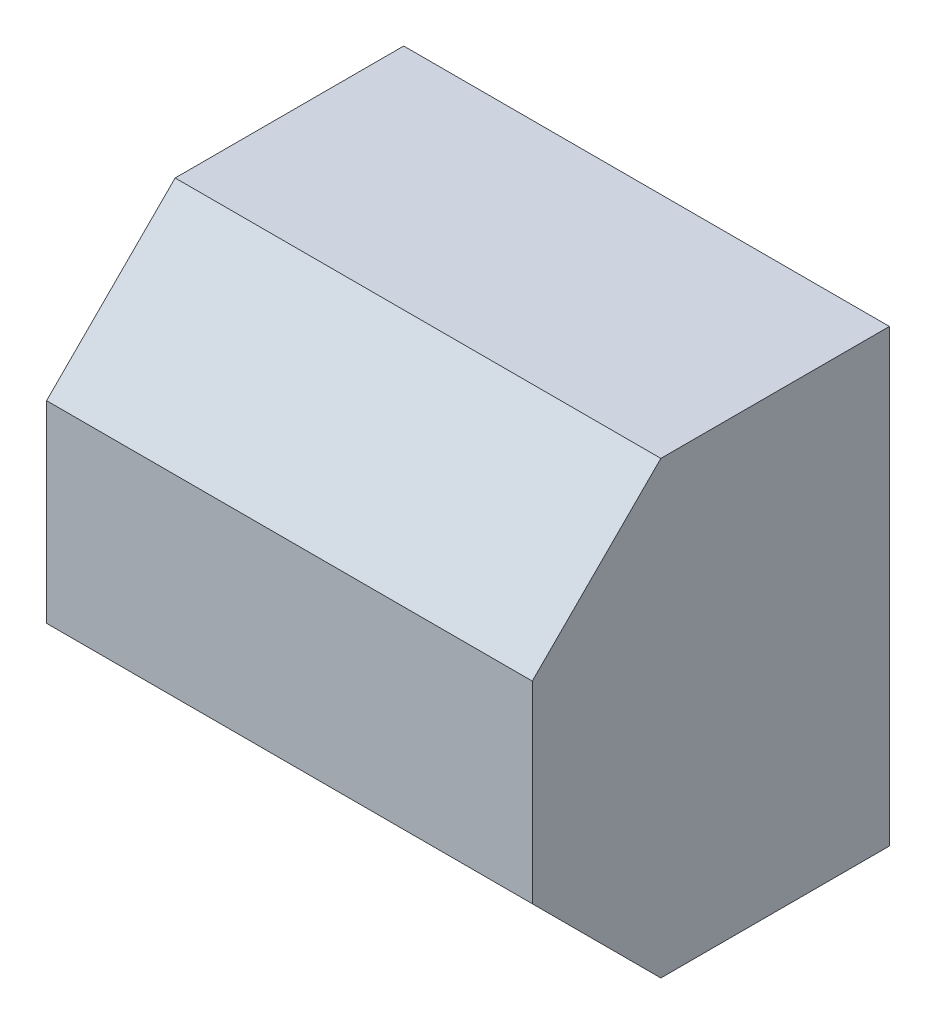
ISO-10303-21;
HEADER;
FILE_DESCRIPTION(('STEP AP214'),'2;1');
FILE_NAME('part.step','',(''),(''),'','','');
FILE_SCHEMA(('AUTOMOTIVE_DESIGN { 1 0 10303 214 1 1 1 1 }'));
ENDSEC;
DATA;
#1=APPLICATION_CONTEXT('core data for automotive mechanical design processes');
#2=APPLICATION_PROTOCOL_DEFINITION('international standard','automotive_design',2000,#1);
#3=PRODUCT_CONTEXT('',#1,'mechanical');
#4=PRODUCT('Part','Part','',(#3));
#5=PRODUCT_RELATED_PRODUCT_CATEGORY('part','',(#4));
#6=PRODUCT_DEFINITION_FORMATION('','',#4);
#7=PRODUCT_DEFINITION_CONTEXT('part definition',#1,'design');
#8=PRODUCT_DEFINITION('design','',#6,#7);
#9=PRODUCT_DEFINITION_SHAPE('','',#8);
#10=(LENGTH_UNIT() NAMED_UNIT(*) SI_UNIT(.MILLI.,.METRE.));
#11=(NAMED_UNIT(*) PLANE_ANGLE_UNIT() SI_UNIT($,.RADIAN.));
#12=(NAMED_UNIT(*) SI_UNIT($,.STERADIAN.) SOLID_ANGLE_UNIT());
#13=UNCERTAINTY_MEASURE_WITH_UNIT(LENGTH_MEASURE(1.E-05),#10,'distance_accuracy_value','');
#14=(GEOMETRIC_REPRESENTATION_CONTEXT(3) GLOBAL_UNCERTAINTY_ASSIGNED_CONTEXT((#13)) GLOBAL_UNIT_ASSIGNED_CONTEXT((#10,
#11,#12)) REPRESENTATION_CONTEXT('',''));
#15=CARTESIAN_POINT('',(0.,0.,0.));
#16=DIRECTION('',(0.,0.,1.));
#17=DIRECTION('',(1.,0.,0.));
#18=AXIS2_PLACEMENT_3D('',#15,#16,#17);
#19=CARTESIAN_POINT('',(-5.53165757678845,2.59408886227179,5.));
#20=DIRECTION('',(1.,0.,0.));
#21=DIRECTION('',(0.,0.,-1.));
#22=AXIS2_PLACEMENT_3D('',#19,#20,#21);
#23=PLANE('',#22);
#24=DIRECTION('',(0.,0.,-1.));
#25=VECTOR('',#24,1.);
#26=CARTESIAN_POINT('',(-5.53165757678845,-3.70591113772821,5.));
#27=LINE('',#26,#25);
#28=CARTESIAN_POINT('',(-5.53165757678845,-3.70591113772821,3.2));
#29=VERTEX_POINT('',#28);
#30=CARTESIAN_POINT('',(-5.53165757678845,-3.70591113772821,0.));
#31=VERTEX_POINT('',#30);
#32=EDGE_CURVE('E91',#29,#31,#27,.T.);
#33=ORIENTED_EDGE('',*,*,#32,.F.);
#34=DIRECTION('',(0.,0.707106781186547,0.707106781186548));
#35=VECTOR('',#34,1.);
#36=CARTESIAN_POINT('',(-5.53165757678845,-1.90591113772821,5.));
#37=LINE('',#36,#35);
#38=CARTESIAN_POINT('',(-5.53165757678845,-1.90591113772821,5.));
#39=VERTEX_POINT('',#38);
#40=EDGE_CURVE('E48',#29,#39,#37,.T.);
#41=ORIENTED_EDGE('',*,*,#40,.T.);
#42=DIRECTION('',(0.,-1.,0.));
#43=VECTOR('',#42,1.);
#44=CARTESIAN_POINT('',(-5.53165757678845,2.59408886227179,5.));
#45=LINE('',#44,#43);
#46=CARTESIAN_POINT('',(-5.53165757678845,0.794088862271789,5.));
#47=VERTEX_POINT('',#46);
#48=EDGE_CURVE('E119',#47,#39,#45,.T.);
#49=ORIENTED_EDGE('',*,*,#48,.F.);
#50=DIRECTION('',(0.,0.707106781186547,-0.707106781186548));
#51=VECTOR('',#50,1.);
#52=CARTESIAN_POINT('',(-5.53165757678845,0.794088862271789,5.));
#53=LINE('',#52,#51);
#54=CARTESIAN_POINT('',(-5.53165757678845,2.59408886227179,3.2));
#55=VERTEX_POINT('',#54);
#56=EDGE_CURVE('E55',#47,#55,#53,.T.);
#57=ORIENTED_EDGE('',*,*,#56,.T.);
#58=DIRECTION('',(0.,0.,-1.));
#59=VECTOR('',#58,1.);
#60=CARTESIAN_POINT('',(-5.53165757678845,2.59408886227179,5.));
#61=LINE('',#60,#59);
#62=CARTESIAN_POINT('',(-5.53165757678845,2.59408886227179,0.));
#63=VERTEX_POINT('',#62);
#64=EDGE_CURVE('E109',#55,#63,#61,.T.);
#65=ORIENTED_EDGE('',*,*,#64,.T.);
#66=DIRECTION('',(0.,-1.,0.));
#67=VECTOR('',#66,1.);
#68=CARTESIAN_POINT('',(-5.53165757678845,2.59408886227179,0.));
#69=LINE('',#68,#67);
#70=EDGE_CURVE('E105',#63,#31,#69,.T.);
#71=ORIENTED_EDGE('',*,*,#70,.T.);
#72=EDGE_LOOP('',(#33,#41,#49,#57,#65,#71));
#73=FACE_BOUND('',#72,.T.);
#74=ADVANCED_FACE('F39',(#73),#23,.F.);
#75=CARTESIAN_POINT('',(-5.53165757678845,-3.70591113772821,5.));
#76=DIRECTION('',(0.,1.,0.));
#77=DIRECTION('',(0.,0.,1.));
#78=AXIS2_PLACEMENT_3D('',#75,#76,#77);
#79=PLANE('',#78);
#80=DIRECTION('',(0.,0.,-1.));
#81=VECTOR('',#80,1.);
#82=CARTESIAN_POINT('',(1.26834242321155,-3.70591113772821,5.));
#83=LINE('',#82,#81);
#84=CARTESIAN_POINT('',(1.26834242321155,-3.70591113772821,3.2));
#85=VERTEX_POINT('',#84);
#86=CARTESIAN_POINT('',(1.26834242321155,-3.70591113772821,0.));
#87=VERTEX_POINT('',#86);
#88=EDGE_CURVE('E99',#85,#87,#83,.T.);
#89=ORIENTED_EDGE('',*,*,#88,.F.);
#90=DIRECTION('',(-1.,0.,0.));
#91=VECTOR('',#90,1.);
#92=CARTESIAN_POINT('',(-5.53165757678845,-3.70591113772821,3.2));
#93=LINE('',#92,#91);
#94=EDGE_CURVE('E63',#85,#29,#93,.T.);
#95=ORIENTED_EDGE('',*,*,#94,.T.);
#96=ORIENTED_EDGE('',*,*,#32,.T.);
#97=DIRECTION('',(1.,0.,0.));
#98=VECTOR('',#97,1.);
#99=CARTESIAN_POINT('',(-5.53165757678845,-3.70591113772821,0.));
#100=LINE('',#99,#98);
#101=EDGE_CURVE('E94',#31,#87,#100,.T.);
#102=ORIENTED_EDGE('',*,*,#101,.T.);
#103=EDGE_LOOP('',(#89,#95,#96,#102));
#104=FACE_BOUND('',#103,.T.);
#105=ADVANCED_FACE('F93',(#104),#79,.F.);
#106=CARTESIAN_POINT('',(1.26834242321155,2.59408886227179,5.));
#107=DIRECTION('',(-1.,0.,0.));
#108=DIRECTION('',(0.,-1.,0.));
#109=AXIS2_PLACEMENT_3D('',#106,#107,#108);
#110=PLANE('',#109);
#111=DIRECTION('',(0.,1.,0.));
#112=VECTOR('',#111,1.);
#113=CARTESIAN_POINT('',(1.26834242321155,2.59408886227179,5.));
#114=LINE('',#113,#112);
#115=CARTESIAN_POINT('',(1.26834242321155,-1.90591113772821,5.));
#116=VERTEX_POINT('',#115);
#117=CARTESIAN_POINT('',(1.26834242321155,0.794088862271789,5.));
#118=VERTEX_POINT('',#117);
#119=EDGE_CURVE('E113',#116,#118,#114,.T.);
#120=ORIENTED_EDGE('',*,*,#119,.F.);
#121=DIRECTION('',(0.,-0.707106781186547,-0.707106781186548));
#122=VECTOR('',#121,1.);
#123=CARTESIAN_POINT('',(1.26834242321155,-1.90591113772821,5.));
#124=LINE('',#123,#122);
#125=EDGE_CURVE('E131',#116,#85,#124,.T.);
#126=ORIENTED_EDGE('',*,*,#125,.T.);
#127=ORIENTED_EDGE('',*,*,#88,.T.);
#128=DIRECTION('',(0.,1.,0.));
#129=VECTOR('',#128,1.);
#130=CARTESIAN_POINT('',(1.26834242321155,2.59408886227179,0.));
#131=LINE('',#130,#129);
#132=CARTESIAN_POINT('',(1.26834242321155,2.59408886227179,0.));
#133=VERTEX_POINT('',#132);
#134=EDGE_CURVE('E107',#87,#133,#131,.T.);
#135=ORIENTED_EDGE('',*,*,#134,.T.);
#136=DIRECTION('',(0.,0.,-1.));
#137=VECTOR('',#136,1.);
#138=CARTESIAN_POINT('',(1.26834242321155,2.59408886227179,5.));
#139=LINE('',#138,#137);
#140=CARTESIAN_POINT('',(1.26834242321155,2.59408886227179,3.2));
#141=VERTEX_POINT('',#140);
#142=EDGE_CURVE('E121',#141,#133,#139,.T.);
#143=ORIENTED_EDGE('',*,*,#142,.F.);
#144=DIRECTION('',(0.,-0.707106781186547,0.707106781186548));
#145=VECTOR('',#144,1.);
#146=CARTESIAN_POINT('',(1.26834242321155,0.794088862271789,5.));
#147=LINE('',#146,#145);
#148=EDGE_CURVE('E129',#141,#118,#147,.T.);
#149=ORIENTED_EDGE('',*,*,#148,.T.);
#150=EDGE_LOOP('',(#120,#126,#127,#135,#143,#149));
#151=FACE_BOUND('',#150,.T.);
#152=ADVANCED_FACE('F144',(#151),#110,.F.);
#153=CARTESIAN_POINT('',(-5.53165757678845,2.59408886227179,5.));
#154=DIRECTION('',(0.,-1.,0.));
#155=DIRECTION('',(0.,0.,-1.));
#156=AXIS2_PLACEMENT_3D('',#153,#154,#155);
#157=PLANE('',#156);
#158=ORIENTED_EDGE('',*,*,#64,.F.);
#159=DIRECTION('',(1.,0.,0.));
#160=VECTOR('',#159,1.);
#161=CARTESIAN_POINT('',(1.26834242321155,2.59408886227179,3.2));
#162=LINE('',#161,#160);
#163=EDGE_CURVE('E11',#55,#141,#162,.T.);
#164=ORIENTED_EDGE('',*,*,#163,.T.);
#165=ORIENTED_EDGE('',*,*,#142,.T.);
#166=DIRECTION('',(-1.,0.,0.));
#167=VECTOR('',#166,1.);
#168=CARTESIAN_POINT('',(-5.53165757678845,2.59408886227179,0.));
#169=LINE('',#168,#167);
#170=EDGE_CURVE('E117',#133,#63,#169,.T.);
#171=ORIENTED_EDGE('',*,*,#170,.T.);
#172=EDGE_LOOP('',(#158,#164,#165,#171));
#173=FACE_BOUND('',#172,.T.);
#174=ADVANCED_FACE('F150',(#173),#157,.F.);
#175=CARTESIAN_POINT('',(0.,0.,5.));
#176=DIRECTION('',(0.,0.,1.));
#177=DIRECTION('',(1.,0.,0.));
#178=AXIS2_PLACEMENT_3D('',#175,#176,#177);
#179=PLANE('',#178);
#180=ORIENTED_EDGE('',*,*,#48,.T.);
#181=DIRECTION('',(1.,0.,0.));
#182=VECTOR('',#181,1.);
#183=CARTESIAN_POINT('',(1.26834242321155,-1.90591113772821,5.));
#184=LINE('',#183,#182);
#185=EDGE_CURVE('E126',#39,#116,#184,.T.);
#186=ORIENTED_EDGE('',*,*,#185,.T.);
#187=ORIENTED_EDGE('',*,*,#119,.T.);
#188=DIRECTION('',(-1.,0.,0.));
#189=VECTOR('',#188,1.);
#190=CARTESIAN_POINT('',(-5.53165757678845,0.794088862271789,5.));
#191=LINE('',#190,#189);
#192=EDGE_CURVE('E98',#118,#47,#191,.T.);
#193=ORIENTED_EDGE('',*,*,#192,.T.);
#194=EDGE_LOOP('',(#180,#186,#187,#193));
#195=FACE_BOUND('',#194,.T.);
#196=ADVANCED_FACE('F138',(#195),#179,.T.);
#197=CARTESIAN_POINT('',(0.,0.,0.));
#198=DIRECTION('',(0.,0.,1.));
#199=DIRECTION('',(1.,0.,0.));
#200=AXIS2_PLACEMENT_3D('',#197,#198,#199);
#201=PLANE('',#200);
#202=ORIENTED_EDGE('',*,*,#70,.F.);
#203=ORIENTED_EDGE('',*,*,#170,.F.);
#204=ORIENTED_EDGE('',*,*,#134,.F.);
#205=ORIENTED_EDGE('',*,*,#101,.F.);
#206=EDGE_LOOP('',(#202,#203,#204,#205));
#207=FACE_BOUND('',#206,.T.);
#208=ADVANCED_FACE('F103',(#207),#201,.F.);
#209=CARTESIAN_POINT('',(0.,-1.90591113772821,5.));
#210=DIRECTION('',(0.,-0.707106781186548,0.707106781186547));
#211=DIRECTION('',(-1.,0.,0.));
#212=AXIS2_PLACEMENT_3D('',#209,#210,#211);
#213=PLANE('',#212);
#214=ORIENTED_EDGE('',*,*,#40,.F.);
#215=ORIENTED_EDGE('',*,*,#94,.F.);
#216=ORIENTED_EDGE('',*,*,#125,.F.);
#217=ORIENTED_EDGE('',*,*,#185,.F.);
#218=EDGE_LOOP('',(#214,#215,#216,#217));
#219=FACE_BOUND('',#218,.T.);
#220=ADVANCED_FACE('F142',(#219),#213,.T.);
#221=CARTESIAN_POINT('',(0.,0.794088862271789,5.));
#222=DIRECTION('',(0.,0.707106781186548,0.707106781186547));
#223=DIRECTION('',(1.,0.,0.));
#224=AXIS2_PLACEMENT_3D('',#221,#222,#223);
#225=PLANE('',#224);
#226=ORIENTED_EDGE('',*,*,#148,.F.);
#227=ORIENTED_EDGE('',*,*,#163,.F.);
#228=ORIENTED_EDGE('',*,*,#56,.F.);
#229=ORIENTED_EDGE('',*,*,#192,.F.);
#230=EDGE_LOOP('',(#226,#227,#228,#229));
#231=FACE_BOUND('',#230,.T.);
#232=ADVANCED_FACE('F42',(#231),#225,.T.);
#233=CLOSED_SHELL('',(#74,#105,#152,#174,#196,#208,#220,#232));
#234=MANIFOLD_SOLID_BREP('B2',#233);
#235=ADVANCED_BREP_SHAPE_REPRESENTATION('',(#18,#234),#14);
#236=SHAPE_DEFINITION_REPRESENTATION(#9,#235);
ENDSEC;
END-ISO-10303-21;
